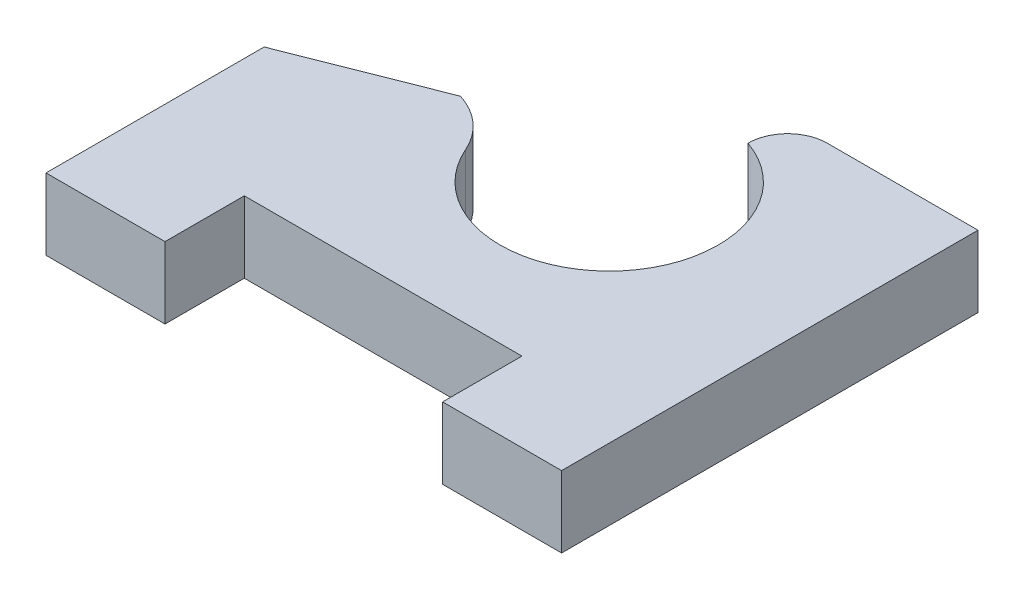
ISO-10303-21;
HEADER;
FILE_DESCRIPTION(('STEP AP214'),'2;1');
FILE_NAME('part.step','',(''),(''),'','','');
FILE_SCHEMA(('AUTOMOTIVE_DESIGN { 1 0 10303 214 1 1 1 1 }'));
ENDSEC;
DATA;
#1=APPLICATION_CONTEXT('core data for automotive mechanical design processes');
#2=APPLICATION_PROTOCOL_DEFINITION('international standard','automotive_design',2000,#1);
#3=PRODUCT_CONTEXT('',#1,'mechanical');
#4=PRODUCT('Part','Part','',(#3));
#5=PRODUCT_RELATED_PRODUCT_CATEGORY('part','',(#4));
#6=PRODUCT_DEFINITION_FORMATION('','',#4);
#7=PRODUCT_DEFINITION_CONTEXT('part definition',#1,'design');
#8=PRODUCT_DEFINITION('design','',#6,#7);
#9=PRODUCT_DEFINITION_SHAPE('','',#8);
#10=(LENGTH_UNIT() NAMED_UNIT(*) SI_UNIT(.MILLI.,.METRE.));
#11=(NAMED_UNIT(*) PLANE_ANGLE_UNIT() SI_UNIT($,.RADIAN.));
#12=(NAMED_UNIT(*) SI_UNIT($,.STERADIAN.) SOLID_ANGLE_UNIT());
#13=UNCERTAINTY_MEASURE_WITH_UNIT(LENGTH_MEASURE(1.E-05),#10,'distance_accuracy_value','');
#14=(GEOMETRIC_REPRESENTATION_CONTEXT(3) GLOBAL_UNCERTAINTY_ASSIGNED_CONTEXT((#13)) GLOBAL_UNIT_ASSIGNED_CONTEXT((#10,
#11,#12)) REPRESENTATION_CONTEXT('',''));
#15=CARTESIAN_POINT('',(0.,0.,0.));
#16=DIRECTION('',(0.,0.,1.));
#17=DIRECTION('',(1.,0.,0.));
#18=AXIS2_PLACEMENT_3D('',#15,#16,#17);
#19=CARTESIAN_POINT('',(0.800000000000001,1.8,-4.9));
#20=DIRECTION('',(0.,-1.,0.));
#21=DIRECTION('',(0.,0.,-1.));
#22=AXIS2_PLACEMENT_3D('',#19,#20,#21);
#23=CYLINDRICAL_SURFACE('',#22,2.75);
#24=CARTESIAN_POINT('',(0.800000000000001,0.,-4.9));
#25=DIRECTION('',(0.,-1.,0.));
#26=DIRECTION('',(0.,0.,1.));
#27=AXIS2_PLACEMENT_3D('',#24,#25,#26);
#28=CIRCLE('',#27,2.75);
#29=CARTESIAN_POINT('',(1.7,0.,-7.49855729203726));
#30=VERTEX_POINT('',#29);
#31=CARTESIAN_POINT('',(-1.71842105263158,0.,-3.79543881941196));
#32=VERTEX_POINT('',#31);
#33=EDGE_CURVE('E158',#30,#32,#28,.T.);
#34=ORIENTED_EDGE('',*,*,#33,.T.);
#35=DIRECTION('',(0.,-1.,0.));
#36=VECTOR('',#35,1.);
#37=CARTESIAN_POINT('',(-1.71842105263158,1.8,-3.79543881941196));
#38=LINE('',#37,#36);
#39=CARTESIAN_POINT('',(-1.71842105263158,1.8,-3.79543881941196));
#40=VERTEX_POINT('',#39);
#41=EDGE_CURVE('E132',#32,#40,#38,.F.);
#42=ORIENTED_EDGE('',*,*,#41,.T.);
#43=CARTESIAN_POINT('',(0.800000000000001,1.8,-4.9));
#44=DIRECTION('',(0.,-1.,0.));
#45=DIRECTION('',(0.,0.,1.));
#46=AXIS2_PLACEMENT_3D('',#43,#44,#45);
#47=CIRCLE('',#46,2.75);
#48=CARTESIAN_POINT('',(1.7,1.8,-7.49855729203726));
#49=VERTEX_POINT('',#48);
#50=EDGE_CURVE('E128',#49,#40,#47,.T.);
#51=ORIENTED_EDGE('',*,*,#50,.F.);
#52=DIRECTION('',(0.,-1.,0.));
#53=VECTOR('',#52,1.);
#54=CARTESIAN_POINT('',(1.7,1.8,-7.49855729203726));
#55=LINE('',#54,#53);
#56=EDGE_CURVE('E159',#49,#30,#55,.T.);
#57=ORIENTED_EDGE('',*,*,#56,.T.);
#58=EDGE_LOOP('',(#34,#42,#51,#57));
#59=FACE_BOUND('',#58,.T.);
#60=ADVANCED_FACE('F33',(#59),#23,.F.);
#61=CARTESIAN_POINT('',(-2.95,1.8,-4.9));
#62=DIRECTION('',(0.366868197965034,0.,0.930272930554194));
#63=DIRECTION('',(0.930272930554194,0.,-0.366868197965034));
#64=AXIS2_PLACEMENT_3D('',#61,#62,#63);
#65=PLANE('',#64);
#66=DIRECTION('',(-0.930272930554194,0.,0.366868197965034));
#67=VECTOR('',#66,1.);
#68=CARTESIAN_POINT('',(-2.95,0.,-4.9));
#69=LINE('',#68,#67);
#70=CARTESIAN_POINT('',(-2.95,0.,-4.9));
#71=VERTEX_POINT('',#70);
#72=CARTESIAN_POINT('',(-6.5,0.,-3.5));
#73=VERTEX_POINT('',#72);
#74=EDGE_CURVE('E160',#71,#73,#69,.T.);
#75=ORIENTED_EDGE('',*,*,#74,.T.);
#76=DIRECTION('',(0.,-1.,0.));
#77=VECTOR('',#76,1.);
#78=CARTESIAN_POINT('',(-6.5,1.8,-3.5));
#79=LINE('',#78,#77);
#80=CARTESIAN_POINT('',(-6.5,1.8,-3.5));
#81=VERTEX_POINT('',#80);
#82=EDGE_CURVE('E141',#81,#73,#79,.T.);
#83=ORIENTED_EDGE('',*,*,#82,.F.);
#84=DIRECTION('',(-0.930272930554194,0.,0.366868197965034));
#85=VECTOR('',#84,1.);
#86=CARTESIAN_POINT('',(-2.95,1.8,-4.9));
#87=LINE('',#86,#85);
#88=CARTESIAN_POINT('',(-2.95,1.8,-4.9));
#89=VERTEX_POINT('',#88);
#90=EDGE_CURVE('E125',#89,#81,#87,.T.);
#91=ORIENTED_EDGE('',*,*,#90,.F.);
#92=DIRECTION('',(0.,-1.,0.));
#93=VECTOR('',#92,1.);
#94=CARTESIAN_POINT('',(-2.95,1.8,-4.9));
#95=LINE('',#94,#93);
#96=EDGE_CURVE('E138',#89,#71,#95,.T.);
#97=ORIENTED_EDGE('',*,*,#96,.T.);
#98=EDGE_LOOP('',(#75,#83,#91,#97));
#99=FACE_BOUND('',#98,.T.);
#100=ADVANCED_FACE('F137',(#99),#65,.F.);
#101=CARTESIAN_POINT('',(-6.5,1.8,0.));
#102=DIRECTION('',(1.,0.,0.));
#103=DIRECTION('',(0.,0.,-1.));
#104=AXIS2_PLACEMENT_3D('',#101,#102,#103);
#105=PLANE('',#104);
#106=DIRECTION('',(0.,0.,1.));
#107=VECTOR('',#106,1.);
#108=CARTESIAN_POINT('',(-6.5,0.,0.));
#109=LINE('',#108,#107);
#110=CARTESIAN_POINT('',(-6.5,0.,2.));
#111=VERTEX_POINT('',#110);
#112=EDGE_CURVE('E162',#73,#111,#109,.T.);
#113=ORIENTED_EDGE('',*,*,#112,.T.);
#114=DIRECTION('',(0.,-1.,0.));
#115=VECTOR('',#114,1.);
#116=CARTESIAN_POINT('',(-6.5,1.8,2.));
#117=LINE('',#116,#115);
#118=CARTESIAN_POINT('',(-6.5,1.8,2.));
#119=VERTEX_POINT('',#118);
#120=EDGE_CURVE('E149',#119,#111,#117,.T.);
#121=ORIENTED_EDGE('',*,*,#120,.F.);
#122=DIRECTION('',(0.,0.,1.));
#123=VECTOR('',#122,1.);
#124=CARTESIAN_POINT('',(-6.5,1.8,-2.5));
#125=LINE('',#124,#123);
#126=EDGE_CURVE('E143',#81,#119,#125,.T.);
#127=ORIENTED_EDGE('',*,*,#126,.F.);
#128=ORIENTED_EDGE('',*,*,#82,.T.);
#129=EDGE_LOOP('',(#113,#121,#127,#128));
#130=FACE_BOUND('',#129,.T.);
#131=ADVANCED_FACE('F247',(#130),#105,.F.);
#132=CARTESIAN_POINT('',(-6.5,1.8,2.));
#133=DIRECTION('',(0.,0.,-1.));
#134=DIRECTION('',(-1.,0.,0.));
#135=AXIS2_PLACEMENT_3D('',#132,#133,#134);
#136=PLANE('',#135);
#137=DIRECTION('',(1.,0.,0.));
#138=VECTOR('',#137,1.);
#139=CARTESIAN_POINT('',(-6.5,0.,2.));
#140=LINE('',#139,#138);
#141=CARTESIAN_POINT('',(-3.5,0.,2.));
#142=VERTEX_POINT('',#141);
#143=EDGE_CURVE('E169',#111,#142,#140,.T.);
#144=ORIENTED_EDGE('',*,*,#143,.T.);
#145=DIRECTION('',(0.,-1.,0.));
#146=VECTOR('',#145,1.);
#147=CARTESIAN_POINT('',(-3.5,1.8,2.));
#148=LINE('',#147,#146);
#149=CARTESIAN_POINT('',(-3.5,1.8,2.));
#150=VERTEX_POINT('',#149);
#151=EDGE_CURVE('E200',#150,#142,#148,.T.);
#152=ORIENTED_EDGE('',*,*,#151,.F.);
#153=DIRECTION('',(1.,0.,0.));
#154=VECTOR('',#153,1.);
#155=CARTESIAN_POINT('',(-6.5,1.8,2.));
#156=LINE('',#155,#154);
#157=EDGE_CURVE('E209',#119,#150,#156,.T.);
#158=ORIENTED_EDGE('',*,*,#157,.F.);
#159=ORIENTED_EDGE('',*,*,#120,.T.);
#160=EDGE_LOOP('',(#144,#152,#158,#159));
#161=FACE_BOUND('',#160,.T.);
#162=ADVANCED_FACE('F207',(#161),#136,.F.);
#163=CARTESIAN_POINT('',(-3.5,1.8,0.));
#164=DIRECTION('',(-1.,0.,0.));
#165=DIRECTION('',(0.,0.,1.));
#166=AXIS2_PLACEMENT_3D('',#163,#164,#165);
#167=PLANE('',#166);
#168=DIRECTION('',(0.,0.,-1.));
#169=VECTOR('',#168,1.);
#170=CARTESIAN_POINT('',(-3.5,0.,0.));
#171=LINE('',#170,#169);
#172=CARTESIAN_POINT('',(-3.5,0.,0.));
#173=VERTEX_POINT('',#172);
#174=EDGE_CURVE('E171',#142,#173,#171,.T.);
#175=ORIENTED_EDGE('',*,*,#174,.T.);
#176=DIRECTION('',(0.,-1.,0.));
#177=VECTOR('',#176,1.);
#178=CARTESIAN_POINT('',(-3.5,1.8,0.));
#179=LINE('',#178,#177);
#180=CARTESIAN_POINT('',(-3.5,1.8,0.));
#181=VERTEX_POINT('',#180);
#182=EDGE_CURVE('E197',#181,#173,#179,.T.);
#183=ORIENTED_EDGE('',*,*,#182,.F.);
#184=DIRECTION('',(0.,0.,-1.));
#185=VECTOR('',#184,1.);
#186=CARTESIAN_POINT('',(-3.5,1.8,0.));
#187=LINE('',#186,#185);
#188=EDGE_CURVE('E226',#150,#181,#187,.T.);
#189=ORIENTED_EDGE('',*,*,#188,.F.);
#190=ORIENTED_EDGE('',*,*,#151,.T.);
#191=EDGE_LOOP('',(#175,#183,#189,#190));
#192=FACE_BOUND('',#191,.T.);
#193=ADVANCED_FACE('F217',(#192),#167,.F.);
#194=CARTESIAN_POINT('',(3.5,1.8,0.));
#195=DIRECTION('',(0.,0.,-1.));
#196=DIRECTION('',(-1.,0.,0.));
#197=AXIS2_PLACEMENT_3D('',#194,#195,#196);
#198=PLANE('',#197);
#199=DIRECTION('',(1.,0.,0.));
#200=VECTOR('',#199,1.);
#201=CARTESIAN_POINT('',(3.5,0.,0.));
#202=LINE('',#201,#200);
#203=CARTESIAN_POINT('',(3.5,0.,0.));
#204=VERTEX_POINT('',#203);
#205=EDGE_CURVE('E173',#173,#204,#202,.T.);
#206=ORIENTED_EDGE('',*,*,#205,.T.);
#207=DIRECTION('',(0.,-1.,0.));
#208=VECTOR('',#207,1.);
#209=CARTESIAN_POINT('',(3.5,1.8,0.));
#210=LINE('',#209,#208);
#211=CARTESIAN_POINT('',(3.5,1.8,0.));
#212=VERTEX_POINT('',#211);
#213=EDGE_CURVE('E194',#212,#204,#210,.T.);
#214=ORIENTED_EDGE('',*,*,#213,.F.);
#215=DIRECTION('',(1.,0.,0.));
#216=VECTOR('',#215,1.);
#217=CARTESIAN_POINT('',(3.5,1.8,0.));
#218=LINE('',#217,#216);
#219=EDGE_CURVE('E223',#181,#212,#218,.T.);
#220=ORIENTED_EDGE('',*,*,#219,.F.);
#221=ORIENTED_EDGE('',*,*,#182,.T.);
#222=EDGE_LOOP('',(#206,#214,#220,#221));
#223=FACE_BOUND('',#222,.T.);
#224=ADVANCED_FACE('F221',(#223),#198,.F.);
#225=CARTESIAN_POINT('',(3.5,1.8,0.));
#226=DIRECTION('',(1.,0.,0.));
#227=DIRECTION('',(0.,0.,-1.));
#228=AXIS2_PLACEMENT_3D('',#225,#226,#227);
#229=PLANE('',#228);
#230=DIRECTION('',(0.,0.,1.));
#231=VECTOR('',#230,1.);
#232=CARTESIAN_POINT('',(3.5,0.,0.));
#233=LINE('',#232,#231);
#234=CARTESIAN_POINT('',(3.5,0.,2.));
#235=VERTEX_POINT('',#234);
#236=EDGE_CURVE('E175',#204,#235,#233,.T.);
#237=ORIENTED_EDGE('',*,*,#236,.T.);
#238=DIRECTION('',(0.,-1.,0.));
#239=VECTOR('',#238,1.);
#240=CARTESIAN_POINT('',(3.5,1.8,2.));
#241=LINE('',#240,#239);
#242=CARTESIAN_POINT('',(3.5,1.8,2.));
#243=VERTEX_POINT('',#242);
#244=EDGE_CURVE('E191',#243,#235,#241,.T.);
#245=ORIENTED_EDGE('',*,*,#244,.F.);
#246=DIRECTION('',(0.,0.,1.));
#247=VECTOR('',#246,1.);
#248=CARTESIAN_POINT('',(3.5,1.8,0.));
#249=LINE('',#248,#247);
#250=EDGE_CURVE('E225',#212,#243,#249,.T.);
#251=ORIENTED_EDGE('',*,*,#250,.F.);
#252=ORIENTED_EDGE('',*,*,#213,.T.);
#253=EDGE_LOOP('',(#237,#245,#251,#252));
#254=FACE_BOUND('',#253,.T.);
#255=ADVANCED_FACE('F258',(#254),#229,.F.);
#256=CARTESIAN_POINT('',(6.5,1.8,2.));
#257=DIRECTION('',(0.,0.,-1.));
#258=DIRECTION('',(-1.,0.,0.));
#259=AXIS2_PLACEMENT_3D('',#256,#257,#258);
#260=PLANE('',#259);
#261=DIRECTION('',(1.,0.,0.));
#262=VECTOR('',#261,1.);
#263=CARTESIAN_POINT('',(6.5,0.,2.));
#264=LINE('',#263,#262);
#265=CARTESIAN_POINT('',(6.5,0.,2.));
#266=VERTEX_POINT('',#265);
#267=EDGE_CURVE('E177',#235,#266,#264,.T.);
#268=ORIENTED_EDGE('',*,*,#267,.T.);
#269=DIRECTION('',(0.,-1.,0.));
#270=VECTOR('',#269,1.);
#271=CARTESIAN_POINT('',(6.5,1.8,2.));
#272=LINE('',#271,#270);
#273=CARTESIAN_POINT('',(6.5,1.8,2.));
#274=VERTEX_POINT('',#273);
#275=EDGE_CURVE('E188',#274,#266,#272,.T.);
#276=ORIENTED_EDGE('',*,*,#275,.F.);
#277=DIRECTION('',(1.,0.,0.));
#278=VECTOR('',#277,1.);
#279=CARTESIAN_POINT('',(6.5,1.8,2.));
#280=LINE('',#279,#278);
#281=EDGE_CURVE('E228',#243,#274,#280,.T.);
#282=ORIENTED_EDGE('',*,*,#281,.F.);
#283=ORIENTED_EDGE('',*,*,#244,.T.);
#284=EDGE_LOOP('',(#268,#276,#282,#283));
#285=FACE_BOUND('',#284,.T.);
#286=ADVANCED_FACE('F261',(#285),#260,.F.);
#287=CARTESIAN_POINT('',(6.5,1.8,-8.49855729203726));
#288=DIRECTION('',(-1.,0.,0.));
#289=DIRECTION('',(0.,0.,1.));
#290=AXIS2_PLACEMENT_3D('',#287,#288,#289);
#291=PLANE('',#290);
#292=DIRECTION('',(0.,0.,-1.));
#293=VECTOR('',#292,1.);
#294=CARTESIAN_POINT('',(6.5,0.,-8.49855729203726));
#295=LINE('',#294,#293);
#296=CARTESIAN_POINT('',(6.5,0.,-8.49855729203726));
#297=VERTEX_POINT('',#296);
#298=EDGE_CURVE('E180',#266,#297,#295,.T.);
#299=ORIENTED_EDGE('',*,*,#298,.T.);
#300=DIRECTION('',(0.,-1.,0.));
#301=VECTOR('',#300,1.);
#302=CARTESIAN_POINT('',(6.5,1.8,-8.49855729203726));
#303=LINE('',#302,#301);
#304=CARTESIAN_POINT('',(6.5,1.8,-8.49855729203726));
#305=VERTEX_POINT('',#304);
#306=EDGE_CURVE('E185',#305,#297,#303,.T.);
#307=ORIENTED_EDGE('',*,*,#306,.F.);
#308=DIRECTION('',(0.,0.,-1.));
#309=VECTOR('',#308,1.);
#310=CARTESIAN_POINT('',(6.5,1.8,0.));
#311=LINE('',#310,#309);
#312=EDGE_CURVE('E233',#274,#305,#311,.T.);
#313=ORIENTED_EDGE('',*,*,#312,.F.);
#314=ORIENTED_EDGE('',*,*,#275,.T.);
#315=EDGE_LOOP('',(#299,#307,#313,#314));
#316=FACE_BOUND('',#315,.T.);
#317=ADVANCED_FACE('F265',(#316),#291,.F.);
#318=CARTESIAN_POINT('',(1.7,1.8,-8.49855729203726));
#319=DIRECTION('',(0.,0.,1.));
#320=DIRECTION('',(1.,0.,0.));
#321=AXIS2_PLACEMENT_3D('',#318,#319,#320);
#322=PLANE('',#321);
#323=DIRECTION('',(-1.,0.,0.));
#324=VECTOR('',#323,1.);
#325=CARTESIAN_POINT('',(1.7,0.,-8.49855729203726));
#326=LINE('',#325,#324);
#327=CARTESIAN_POINT('',(2.7,0.,-8.49855729203726));
#328=VERTEX_POINT('',#327);
#329=EDGE_CURVE('E182',#297,#328,#326,.T.);
#330=ORIENTED_EDGE('',*,*,#329,.T.);
#331=DIRECTION('',(0.,-1.,0.));
#332=VECTOR('',#331,1.);
#333=CARTESIAN_POINT('',(2.7,1.8,-8.49855729203726));
#334=LINE('',#333,#332);
#335=CARTESIAN_POINT('',(2.7,1.8,-8.49855729203726));
#336=VERTEX_POINT('',#335);
#337=EDGE_CURVE('E41',#328,#336,#334,.F.);
#338=ORIENTED_EDGE('',*,*,#337,.T.);
#339=DIRECTION('',(-1.,0.,0.));
#340=VECTOR('',#339,1.);
#341=CARTESIAN_POINT('',(1.7,1.8,-8.49855729203726));
#342=LINE('',#341,#340);
#343=EDGE_CURVE('E165',#305,#336,#342,.T.);
#344=ORIENTED_EDGE('',*,*,#343,.F.);
#345=ORIENTED_EDGE('',*,*,#306,.T.);
#346=EDGE_LOOP('',(#330,#338,#344,#345));
#347=FACE_BOUND('',#346,.T.);
#348=ADVANCED_FACE('F269',(#347),#322,.F.);
#349=CARTESIAN_POINT('',(0.800000000000001,1.8,-4.9));
#350=DIRECTION('',(0.,1.,0.));
#351=DIRECTION('',(0.,0.,1.));
#352=AXIS2_PLACEMENT_3D('',#349,#350,#351);
#353=PLANE('',#352);
#354=ORIENTED_EDGE('',*,*,#343,.T.);
#355=CARTESIAN_POINT('',(2.7,1.8,-7.49855729203726));
#356=DIRECTION('',(0.,1.,0.));
#357=DIRECTION('',(0.,0.,1.));
#358=AXIS2_PLACEMENT_3D('',#355,#356,#357);
#359=CIRCLE('',#358,1.);
#360=EDGE_CURVE('E11',#336,#49,#359,.T.);
#361=ORIENTED_EDGE('',*,*,#360,.T.);
#362=ORIENTED_EDGE('',*,*,#50,.T.);
#363=CARTESIAN_POINT('',(-3.55,1.8,-2.99212159716611));
#364=DIRECTION('',(0.,1.,0.));
#365=DIRECTION('',(0.,0.,1.));
#366=AXIS2_PLACEMENT_3D('',#363,#364,#365);
#367=CIRCLE('',#366,2.);
#368=EDGE_CURVE('E122',#40,#89,#367,.T.);
#369=ORIENTED_EDGE('',*,*,#368,.T.);
#370=ORIENTED_EDGE('',*,*,#90,.T.);
#371=ORIENTED_EDGE('',*,*,#126,.T.);
#372=ORIENTED_EDGE('',*,*,#157,.T.);
#373=ORIENTED_EDGE('',*,*,#188,.T.);
#374=ORIENTED_EDGE('',*,*,#219,.T.);
#375=ORIENTED_EDGE('',*,*,#250,.T.);
#376=ORIENTED_EDGE('',*,*,#281,.T.);
#377=ORIENTED_EDGE('',*,*,#312,.T.);
#378=EDGE_LOOP('',(#354,#361,#362,#369,#370,#371,#372,#373,#374,#375,#376,#377));
#379=FACE_BOUND('',#378,.T.);
#380=ADVANCED_FACE('F124',(#379),#353,.T.);
#381=CARTESIAN_POINT('',(0.800000000000001,0.,-4.9));
#382=DIRECTION('',(0.,1.,0.));
#383=DIRECTION('',(0.,0.,1.));
#384=AXIS2_PLACEMENT_3D('',#381,#382,#383);
#385=PLANE('',#384);
#386=ORIENTED_EDGE('',*,*,#33,.F.);
#387=CARTESIAN_POINT('',(2.7,0.,-7.49855729203726));
#388=DIRECTION('',(0.,1.,0.));
#389=DIRECTION('',(0.,0.,1.));
#390=AXIS2_PLACEMENT_3D('',#387,#388,#389);
#391=CIRCLE('',#390,1.);
#392=EDGE_CURVE('E55',#30,#328,#391,.F.);
#393=ORIENTED_EDGE('',*,*,#392,.T.);
#394=ORIENTED_EDGE('',*,*,#329,.F.);
#395=ORIENTED_EDGE('',*,*,#298,.F.);
#396=ORIENTED_EDGE('',*,*,#267,.F.);
#397=ORIENTED_EDGE('',*,*,#236,.F.);
#398=ORIENTED_EDGE('',*,*,#205,.F.);
#399=ORIENTED_EDGE('',*,*,#174,.F.);
#400=ORIENTED_EDGE('',*,*,#143,.F.);
#401=ORIENTED_EDGE('',*,*,#112,.F.);
#402=ORIENTED_EDGE('',*,*,#74,.F.);
#403=CARTESIAN_POINT('',(-3.55,0.,-2.99212159716611));
#404=DIRECTION('',(0.,1.,0.));
#405=DIRECTION('',(0.,0.,1.));
#406=AXIS2_PLACEMENT_3D('',#403,#404,#405);
#407=CIRCLE('',#406,2.);
#408=EDGE_CURVE('E146',#71,#32,#407,.F.);
#409=ORIENTED_EDGE('',*,*,#408,.T.);
#410=EDGE_LOOP('',(#386,#393,#394,#395,#396,#397,#398,#399,#400,#401,#402,#409));
#411=FACE_BOUND('',#410,.T.);
#412=ADVANCED_FACE('F212',(#411),#385,.F.);
#413=CARTESIAN_POINT('',(-3.55,1.8,-2.99212159716611));
#414=DIRECTION('',(0.,-1.,0.));
#415=DIRECTION('',(0.,0.,-1.));
#416=AXIS2_PLACEMENT_3D('',#413,#414,#415);
#417=CYLINDRICAL_SURFACE('',#416,2.);
#418=ORIENTED_EDGE('',*,*,#368,.F.);
#419=ORIENTED_EDGE('',*,*,#41,.F.);
#420=ORIENTED_EDGE('',*,*,#408,.F.);
#421=ORIENTED_EDGE('',*,*,#96,.F.);
#422=EDGE_LOOP('',(#418,#419,#420,#421));
#423=FACE_BOUND('',#422,.T.);
#424=ADVANCED_FACE('F145',(#423),#417,.T.);
#425=CARTESIAN_POINT('',(2.7,1.8,-7.49855729203726));
#426=DIRECTION('',(0.,-1.,0.));
#427=DIRECTION('',(0.,0.,-1.));
#428=AXIS2_PLACEMENT_3D('',#425,#426,#427);
#429=CYLINDRICAL_SURFACE('',#428,1.);
#430=ORIENTED_EDGE('',*,*,#360,.F.);
#431=ORIENTED_EDGE('',*,*,#337,.F.);
#432=ORIENTED_EDGE('',*,*,#392,.F.);
#433=ORIENTED_EDGE('',*,*,#56,.F.);
#434=EDGE_LOOP('',(#430,#431,#432,#433));
#435=FACE_BOUND('',#434,.T.);
#436=ADVANCED_FACE('F35',(#435),#429,.T.);
#437=CLOSED_SHELL('',(#60,#100,#131,#162,#193,#224,#255,#286,#317,#348,#380,#412,#424,#436));
#438=MANIFOLD_SOLID_BREP('B2',#437);
#439=ADVANCED_BREP_SHAPE_REPRESENTATION('',(#18,#438),#14);
#440=SHAPE_DEFINITION_REPRESENTATION(#9,#439);
ENDSEC;
END-ISO-10303-21;
